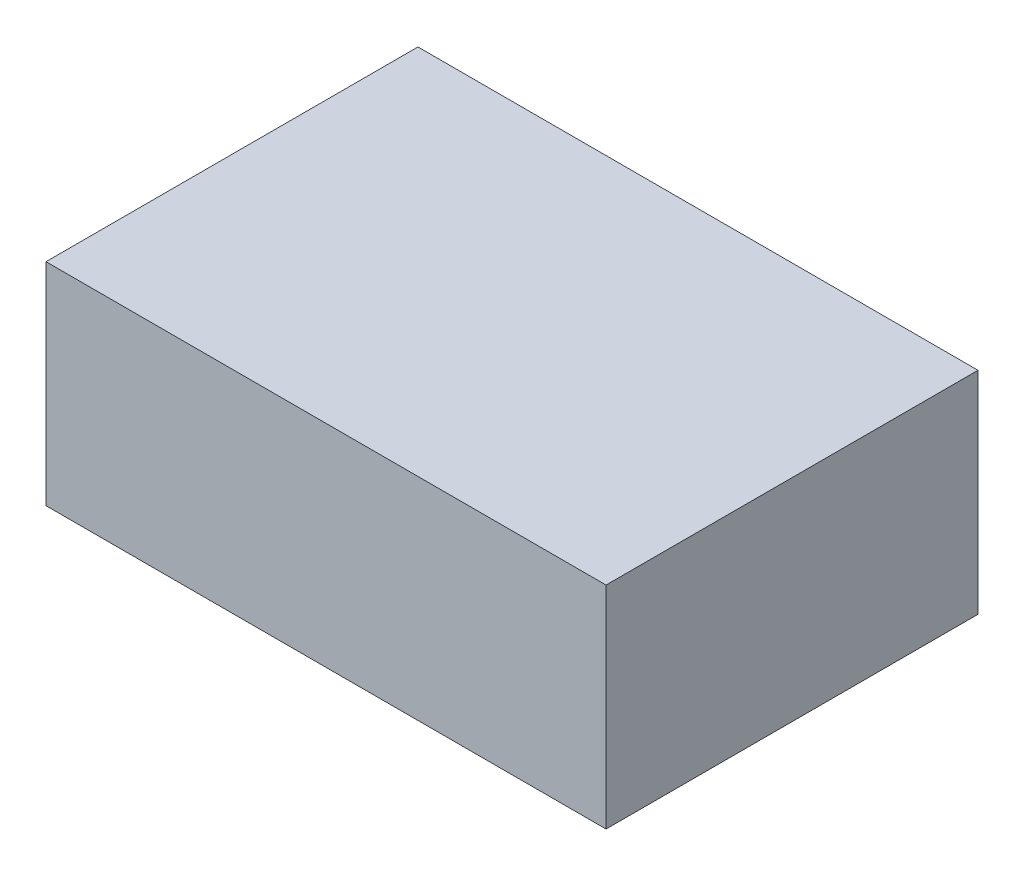
ISO-10303-21;
HEADER;
FILE_DESCRIPTION(('STEP AP214'),'2;1');
FILE_NAME('part.step','',(''),(''),'','','');
FILE_SCHEMA(('AUTOMOTIVE_DESIGN { 1 0 10303 214 1 1 1 1 }'));
ENDSEC;
DATA;
#1=APPLICATION_CONTEXT('core data for automotive mechanical design processes');
#2=APPLICATION_PROTOCOL_DEFINITION('international standard','automotive_design',2000,#1);
#3=PRODUCT_CONTEXT('',#1,'mechanical');
#4=PRODUCT('Part','Part','',(#3));
#5=PRODUCT_RELATED_PRODUCT_CATEGORY('part','',(#4));
#6=PRODUCT_DEFINITION_FORMATION('','',#4);
#7=PRODUCT_DEFINITION_CONTEXT('part definition',#1,'design');
#8=PRODUCT_DEFINITION('design','',#6,#7);
#9=PRODUCT_DEFINITION_SHAPE('','',#8);
#10=(LENGTH_UNIT() NAMED_UNIT(*) SI_UNIT(.MILLI.,.METRE.));
#11=(NAMED_UNIT(*) PLANE_ANGLE_UNIT() SI_UNIT($,.RADIAN.));
#12=(NAMED_UNIT(*) SI_UNIT($,.STERADIAN.) SOLID_ANGLE_UNIT());
#13=UNCERTAINTY_MEASURE_WITH_UNIT(LENGTH_MEASURE(1.E-05),#10,'distance_accuracy_value','');
#14=(GEOMETRIC_REPRESENTATION_CONTEXT(3) GLOBAL_UNCERTAINTY_ASSIGNED_CONTEXT((#13)) GLOBAL_UNIT_ASSIGNED_CONTEXT((#10,
#11,#12)) REPRESENTATION_CONTEXT('',''));
#15=CARTESIAN_POINT('',(0.,0.,0.));
#16=DIRECTION('',(0.,0.,1.));
#17=DIRECTION('',(1.,0.,0.));
#18=AXIS2_PLACEMENT_3D('',#15,#16,#17);
#19=CARTESIAN_POINT('',(41.748180256161,10.,-39.733893826532));
#20=DIRECTION('',(-1.,0.,0.));
#21=DIRECTION('',(0.,0.,1.));
#22=AXIS2_PLACEMENT_3D('',#19,#20,#21);
#23=PLANE('',#22);
#24=DIRECTION('',(0.,0.,-1.));
#25=VECTOR('',#24,1.);
#26=CARTESIAN_POINT('',(41.748180256161,0.,-39.733893826532));
#27=LINE('',#26,#25);
#28=CARTESIAN_POINT('',(41.748180256161,0.,-22.133893826532));
#29=VERTEX_POINT('',#28);
#30=CARTESIAN_POINT('',(41.748180256161,0.,-39.733893826532));
#31=VERTEX_POINT('',#30);
#32=EDGE_CURVE('E112',#29,#31,#27,.T.);
#33=ORIENTED_EDGE('',*,*,#32,.T.);
#34=DIRECTION('',(0.,-1.,0.));
#35=VECTOR('',#34,1.);
#36=CARTESIAN_POINT('',(41.748180256161,10.,-39.733893826532));
#37=LINE('',#36,#35);
#38=CARTESIAN_POINT('',(41.748180256161,10.,-39.733893826532));
#39=VERTEX_POINT('',#38);
#40=EDGE_CURVE('E11',#39,#31,#37,.T.);
#41=ORIENTED_EDGE('',*,*,#40,.F.);
#42=DIRECTION('',(0.,0.,-1.));
#43=VECTOR('',#42,1.);
#44=CARTESIAN_POINT('',(41.748180256161,10.,-39.733893826532));
#45=LINE('',#44,#43);
#46=CARTESIAN_POINT('',(41.748180256161,10.,-22.133893826532));
#47=VERTEX_POINT('',#46);
#48=EDGE_CURVE('E97',#47,#39,#45,.T.);
#49=ORIENTED_EDGE('',*,*,#48,.F.);
#50=DIRECTION('',(0.,-1.,0.));
#51=VECTOR('',#50,1.);
#52=CARTESIAN_POINT('',(41.748180256161,10.,-22.133893826532));
#53=LINE('',#52,#51);
#54=EDGE_CURVE('E108',#47,#29,#53,.T.);
#55=ORIENTED_EDGE('',*,*,#54,.T.);
#56=EDGE_LOOP('',(#33,#41,#49,#55));
#57=FACE_BOUND('',#56,.T.);
#58=ADVANCED_FACE('F45',(#57),#23,.F.);
#59=CARTESIAN_POINT('',(15.248180256161,10.,-39.733893826532));
#60=DIRECTION('',(0.,0.,1.));
#61=DIRECTION('',(1.,0.,0.));
#62=AXIS2_PLACEMENT_3D('',#59,#60,#61);
#63=PLANE('',#62);
#64=DIRECTION('',(-1.,0.,0.));
#65=VECTOR('',#64,1.);
#66=CARTESIAN_POINT('',(15.248180256161,0.,-39.733893826532));
#67=LINE('',#66,#65);
#68=CARTESIAN_POINT('',(15.248180256161,0.,-39.733893826532));
#69=VERTEX_POINT('',#68);
#70=EDGE_CURVE('E102',#31,#69,#67,.T.);
#71=ORIENTED_EDGE('',*,*,#70,.T.);
#72=DIRECTION('',(0.,-1.,0.));
#73=VECTOR('',#72,1.);
#74=CARTESIAN_POINT('',(15.248180256161,10.,-39.733893826532));
#75=LINE('',#74,#73);
#76=CARTESIAN_POINT('',(15.248180256161,10.,-39.733893826532));
#77=VERTEX_POINT('',#76);
#78=EDGE_CURVE('E53',#77,#69,#75,.T.);
#79=ORIENTED_EDGE('',*,*,#78,.F.);
#80=DIRECTION('',(-1.,0.,0.));
#81=VECTOR('',#80,1.);
#82=CARTESIAN_POINT('',(15.248180256161,10.,-39.733893826532));
#83=LINE('',#82,#81);
#84=EDGE_CURVE('E92',#39,#77,#83,.T.);
#85=ORIENTED_EDGE('',*,*,#84,.F.);
#86=ORIENTED_EDGE('',*,*,#40,.T.);
#87=EDGE_LOOP('',(#71,#79,#85,#86));
#88=FACE_BOUND('',#87,.T.);
#89=ADVANCED_FACE('F101',(#88),#63,.F.);
#90=CARTESIAN_POINT('',(15.248180256161,10.,-39.733893826532));
#91=DIRECTION('',(1.,0.,0.));
#92=DIRECTION('',(0.,0.,-1.));
#93=AXIS2_PLACEMENT_3D('',#90,#91,#92);
#94=PLANE('',#93);
#95=DIRECTION('',(0.,0.,1.));
#96=VECTOR('',#95,1.);
#97=CARTESIAN_POINT('',(15.248180256161,0.,-39.733893826532));
#98=LINE('',#97,#96);
#99=CARTESIAN_POINT('',(15.248180256161,0.,-22.133893826532));
#100=VERTEX_POINT('',#99);
#101=EDGE_CURVE('E79',#69,#100,#98,.T.);
#102=ORIENTED_EDGE('',*,*,#101,.T.);
#103=DIRECTION('',(0.,-1.,0.));
#104=VECTOR('',#103,1.);
#105=CARTESIAN_POINT('',(15.248180256161,10.,-22.133893826532));
#106=LINE('',#105,#104);
#107=CARTESIAN_POINT('',(15.248180256161,10.,-22.133893826532));
#108=VERTEX_POINT('',#107);
#109=EDGE_CURVE('E104',#108,#100,#106,.T.);
#110=ORIENTED_EDGE('',*,*,#109,.F.);
#111=DIRECTION('',(0.,0.,1.));
#112=VECTOR('',#111,1.);
#113=CARTESIAN_POINT('',(15.248180256161,10.,-39.733893826532));
#114=LINE('',#113,#112);
#115=EDGE_CURVE('E95',#77,#108,#114,.T.);
#116=ORIENTED_EDGE('',*,*,#115,.F.);
#117=ORIENTED_EDGE('',*,*,#78,.T.);
#118=EDGE_LOOP('',(#102,#110,#116,#117));
#119=FACE_BOUND('',#118,.T.);
#120=ADVANCED_FACE('F105',(#119),#94,.F.);
#121=CARTESIAN_POINT('',(15.248180256161,10.,-22.133893826532));
#122=DIRECTION('',(0.,0.,-1.));
#123=DIRECTION('',(-1.,0.,0.));
#124=AXIS2_PLACEMENT_3D('',#121,#122,#123);
#125=PLANE('',#124);
#126=DIRECTION('',(1.,0.,0.));
#127=VECTOR('',#126,1.);
#128=CARTESIAN_POINT('',(15.248180256161,0.,-22.133893826532));
#129=LINE('',#128,#127);
#130=EDGE_CURVE('E85',#100,#29,#129,.T.);
#131=ORIENTED_EDGE('',*,*,#130,.T.);
#132=ORIENTED_EDGE('',*,*,#54,.F.);
#133=DIRECTION('',(1.,0.,0.));
#134=VECTOR('',#133,1.);
#135=CARTESIAN_POINT('',(15.248180256161,10.,-22.133893826532));
#136=LINE('',#135,#134);
#137=EDGE_CURVE('E61',#108,#47,#136,.T.);
#138=ORIENTED_EDGE('',*,*,#137,.F.);
#139=ORIENTED_EDGE('',*,*,#109,.T.);
#140=EDGE_LOOP('',(#131,#132,#138,#139));
#141=FACE_BOUND('',#140,.T.);
#142=ADVANCED_FACE('F123',(#141),#125,.F.);
#143=CARTESIAN_POINT('',(0.,10.,0.));
#144=DIRECTION('',(0.,1.,0.));
#145=DIRECTION('',(0.,0.,1.));
#146=AXIS2_PLACEMENT_3D('',#143,#144,#145);
#147=PLANE('',#146);
#148=ORIENTED_EDGE('',*,*,#48,.T.);
#149=ORIENTED_EDGE('',*,*,#84,.T.);
#150=ORIENTED_EDGE('',*,*,#115,.T.);
#151=ORIENTED_EDGE('',*,*,#137,.T.);
#152=EDGE_LOOP('',(#148,#149,#150,#151));
#153=FACE_BOUND('',#152,.T.);
#154=ADVANCED_FACE('F93',(#153),#147,.T.);
#155=CARTESIAN_POINT('',(0.,0.,0.));
#156=DIRECTION('',(0.,1.,0.));
#157=DIRECTION('',(0.,0.,1.));
#158=AXIS2_PLACEMENT_3D('',#155,#156,#157);
#159=PLANE('',#158);
#160=ORIENTED_EDGE('',*,*,#32,.F.);
#161=ORIENTED_EDGE('',*,*,#130,.F.);
#162=ORIENTED_EDGE('',*,*,#101,.F.);
#163=ORIENTED_EDGE('',*,*,#70,.F.);
#164=EDGE_LOOP('',(#160,#161,#162,#163));
#165=FACE_BOUND('',#164,.T.);
#166=ADVANCED_FACE('F126',(#165),#159,.F.);
#167=CLOSED_SHELL('',(#58,#89,#120,#142,#154,#166));
#168=MANIFOLD_SOLID_BREP('B2',#167);
#169=ADVANCED_BREP_SHAPE_REPRESENTATION('',(#18,#168),#14);
#170=SHAPE_DEFINITION_REPRESENTATION(#9,#169);
ENDSEC;
END-ISO-10303-21;
